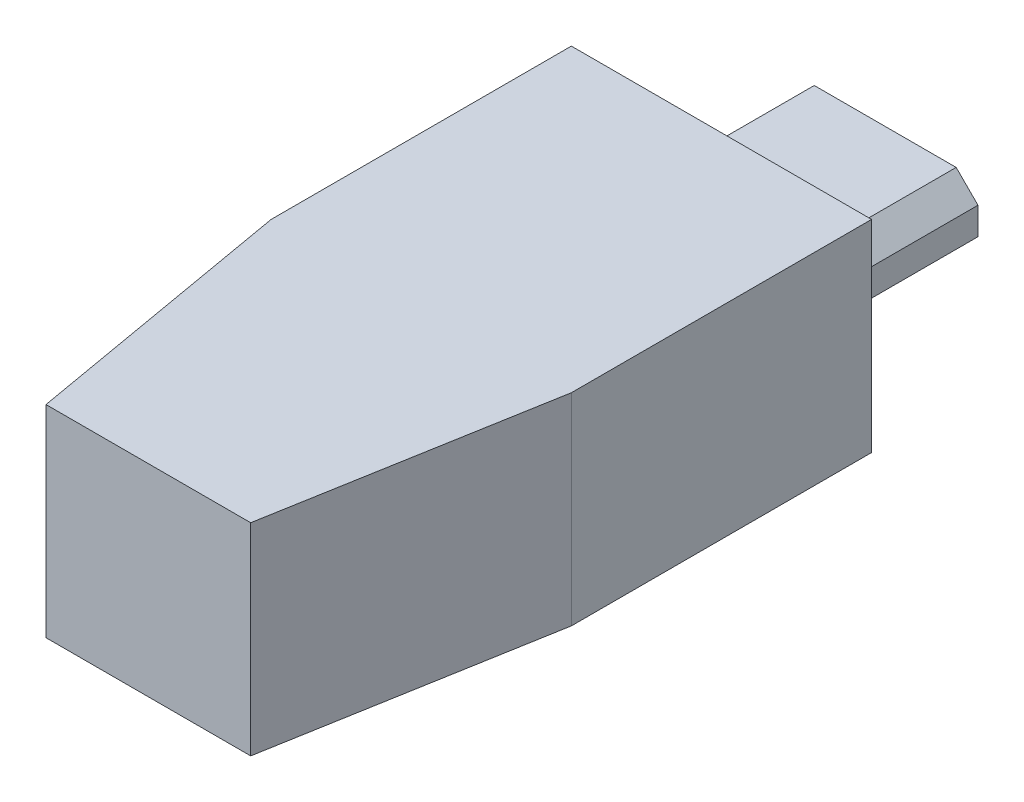
ISO-10303-21;
HEADER;
FILE_DESCRIPTION(('STEP AP214'),'2;1');
FILE_NAME('part.step','',(''),(''),'','','');
FILE_SCHEMA(('AUTOMOTIVE_DESIGN { 1 0 10303 214 1 1 1 1 }'));
ENDSEC;
DATA;
#1=APPLICATION_CONTEXT('core data for automotive mechanical design processes');
#2=APPLICATION_PROTOCOL_DEFINITION('international standard','automotive_design',2000,#1);
#3=PRODUCT_CONTEXT('',#1,'mechanical');
#4=PRODUCT('Part','Part','',(#3));
#5=PRODUCT_RELATED_PRODUCT_CATEGORY('part','',(#4));
#6=PRODUCT_DEFINITION_FORMATION('','',#4);
#7=PRODUCT_DEFINITION_CONTEXT('part definition',#1,'design');
#8=PRODUCT_DEFINITION('design','',#6,#7);
#9=PRODUCT_DEFINITION_SHAPE('','',#8);
#10=(LENGTH_UNIT() NAMED_UNIT(*) SI_UNIT(.MILLI.,.METRE.));
#11=(NAMED_UNIT(*) PLANE_ANGLE_UNIT() SI_UNIT($,.RADIAN.));
#12=(NAMED_UNIT(*) SI_UNIT($,.STERADIAN.) SOLID_ANGLE_UNIT());
#13=UNCERTAINTY_MEASURE_WITH_UNIT(LENGTH_MEASURE(1.E-05),#10,'distance_accuracy_value','');
#14=(GEOMETRIC_REPRESENTATION_CONTEXT(3) GLOBAL_UNCERTAINTY_ASSIGNED_CONTEXT((#13)) GLOBAL_UNIT_ASSIGNED_CONTEXT((#10,
#11,#12)) REPRESENTATION_CONTEXT('',''));
#15=CARTESIAN_POINT('',(0.,0.,0.));
#16=DIRECTION('',(0.,0.,1.));
#17=DIRECTION('',(1.,0.,0.));
#18=AXIS2_PLACEMENT_3D('',#15,#16,#17);
#19=CARTESIAN_POINT('',(0.,0.,0.));
#20=DIRECTION('',(0.,0.,1.));
#21=DIRECTION('',(1.,0.,0.));
#22=AXIS2_PLACEMENT_3D('',#19,#20,#21);
#23=PLANE('',#22);
#24=DIRECTION('',(0.,1.,0.));
#25=VECTOR('',#24,1.);
#26=CARTESIAN_POINT('',(5.5,3.7,0.));
#27=LINE('',#26,#25);
#28=CARTESIAN_POINT('',(5.5,-3.7,0.));
#29=VERTEX_POINT('',#28);
#30=CARTESIAN_POINT('',(5.5,3.7,0.));
#31=VERTEX_POINT('',#30);
#32=EDGE_CURVE('E184',#29,#31,#27,.T.);
#33=ORIENTED_EDGE('',*,*,#32,.F.);
#34=DIRECTION('',(1.,0.,0.));
#35=VECTOR('',#34,1.);
#36=CARTESIAN_POINT('',(-5.5,-3.7,0.));
#37=LINE('',#36,#35);
#38=CARTESIAN_POINT('',(-5.5,-3.7,0.));
#39=VERTEX_POINT('',#38);
#40=EDGE_CURVE('E190',#39,#29,#37,.T.);
#41=ORIENTED_EDGE('',*,*,#40,.F.);
#42=DIRECTION('',(0.,-1.,0.));
#43=VECTOR('',#42,1.);
#44=CARTESIAN_POINT('',(-5.5,3.7,0.));
#45=LINE('',#44,#43);
#46=CARTESIAN_POINT('',(-5.5,3.7,0.));
#47=VERTEX_POINT('',#46);
#48=EDGE_CURVE('E202',#47,#39,#45,.T.);
#49=ORIENTED_EDGE('',*,*,#48,.F.);
#50=DIRECTION('',(-1.,0.,0.));
#51=VECTOR('',#50,1.);
#52=CARTESIAN_POINT('',(-5.5,3.7,0.));
#53=LINE('',#52,#51);
#54=EDGE_CURVE('E198',#31,#47,#53,.T.);
#55=ORIENTED_EDGE('',*,*,#54,.F.);
#56=EDGE_LOOP('',(#33,#41,#49,#55));
#57=FACE_BOUND('',#56,.T.);
#58=DIRECTION('',(0.,1.,0.));
#59=VECTOR('',#58,1.);
#60=CARTESIAN_POINT('',(-3.4,0.0999999999999999,0.));
#61=LINE('',#60,#59);
#62=CARTESIAN_POINT('',(-3.4,-0.9,0.));
#63=VERTEX_POINT('',#62);
#64=CARTESIAN_POINT('',(-3.4,0.0999999999999999,0.));
#65=VERTEX_POINT('',#64);
#66=EDGE_CURVE('E61',#63,#65,#61,.T.);
#67=ORIENTED_EDGE('',*,*,#66,.F.);
#68=DIRECTION('',(-1.,0.,0.));
#69=VECTOR('',#68,1.);
#70=CARTESIAN_POINT('',(3.4,-0.9,0.));
#71=LINE('',#70,#69);
#72=CARTESIAN_POINT('',(3.4,-0.9,0.));
#73=VERTEX_POINT('',#72);
#74=EDGE_CURVE('E65',#73,#63,#71,.T.);
#75=ORIENTED_EDGE('',*,*,#74,.F.);
#76=DIRECTION('',(0.,-1.,0.));
#77=VECTOR('',#76,1.);
#78=CARTESIAN_POINT('',(3.4,0.0999999999999917,0.));
#79=LINE('',#78,#77);
#80=CARTESIAN_POINT('',(3.4,0.0999999999999917,0.));
#81=VERTEX_POINT('',#80);
#82=EDGE_CURVE('E368',#81,#73,#79,.T.);
#83=ORIENTED_EDGE('',*,*,#82,.F.);
#84=DIRECTION('',(0.707106781186543,-0.707106781186552,0.));
#85=VECTOR('',#84,1.);
#86=CARTESIAN_POINT('',(3.4,0.0999999999999917,0.));
#87=LINE('',#86,#85);
#88=CARTESIAN_POINT('',(2.6,0.9,0.));
#89=VERTEX_POINT('',#88);
#90=EDGE_CURVE('E388',#89,#81,#87,.T.);
#91=ORIENTED_EDGE('',*,*,#90,.F.);
#92=DIRECTION('',(1.,0.,0.));
#93=VECTOR('',#92,1.);
#94=CARTESIAN_POINT('',(2.6,0.9,0.));
#95=LINE('',#94,#93);
#96=CARTESIAN_POINT('',(-2.6,0.9,0.));
#97=VERTEX_POINT('',#96);
#98=EDGE_CURVE('E391',#97,#89,#95,.T.);
#99=ORIENTED_EDGE('',*,*,#98,.F.);
#100=DIRECTION('',(0.707106781186547,0.707106781186548,0.));
#101=VECTOR('',#100,1.);
#102=CARTESIAN_POINT('',(-2.6,0.9,0.));
#103=LINE('',#102,#101);
#104=EDGE_CURVE('E393',#65,#97,#103,.T.);
#105=ORIENTED_EDGE('',*,*,#104,.F.);
#106=EDGE_LOOP('',(#67,#75,#83,#91,#99,#105));
#107=FACE_BOUND('',#106,.T.);
#108=ADVANCED_FACE('F45',(#57,#107),#23,.F.);
#109=CARTESIAN_POINT('',(5.5,3.7,21.));
#110=DIRECTION('',(-1.,0.,0.));
#111=DIRECTION('',(0.,0.,1.));
#112=AXIS2_PLACEMENT_3D('',#109,#110,#111);
#113=PLANE('',#112);
#114=DIRECTION('',(0.,0.,-1.));
#115=VECTOR('',#114,1.);
#116=CARTESIAN_POINT('',(5.5,3.7,21.));
#117=LINE('',#116,#115);
#118=CARTESIAN_POINT('',(5.5,3.7,11.));
#119=VERTEX_POINT('',#118);
#120=EDGE_CURVE('E217',#119,#31,#117,.T.);
#121=ORIENTED_EDGE('',*,*,#120,.F.);
#122=DIRECTION('',(0.,1.,0.));
#123=VECTOR('',#122,1.);
#124=CARTESIAN_POINT('',(5.5,-17.3,11.));
#125=LINE('',#124,#123);
#126=CARTESIAN_POINT('',(5.5,-3.7,11.));
#127=VERTEX_POINT('',#126);
#128=EDGE_CURVE('E169',#127,#119,#125,.T.);
#129=ORIENTED_EDGE('',*,*,#128,.F.);
#130=DIRECTION('',(0.,0.,-1.));
#131=VECTOR('',#130,1.);
#132=CARTESIAN_POINT('',(5.5,-3.7,21.));
#133=LINE('',#132,#131);
#134=EDGE_CURVE('E194',#127,#29,#133,.T.);
#135=ORIENTED_EDGE('',*,*,#134,.T.);
#136=ORIENTED_EDGE('',*,*,#32,.T.);
#137=EDGE_LOOP('',(#121,#129,#135,#136));
#138=FACE_BOUND('',#137,.T.);
#139=ADVANCED_FACE('F47',(#138),#113,.F.);
#140=CARTESIAN_POINT('',(-5.5,3.7,21.));
#141=DIRECTION('',(0.,-1.,0.));
#142=DIRECTION('',(0.,0.,-1.));
#143=AXIS2_PLACEMENT_3D('',#140,#141,#142);
#144=PLANE('',#143);
#145=DIRECTION('',(0.,0.,-1.));
#146=VECTOR('',#145,1.);
#147=CARTESIAN_POINT('',(-5.5,3.7,21.));
#148=LINE('',#147,#146);
#149=CARTESIAN_POINT('',(-5.5,3.7,11.));
#150=VERTEX_POINT('',#149);
#151=EDGE_CURVE('E214',#150,#47,#148,.T.);
#152=ORIENTED_EDGE('',*,*,#151,.F.);
#153=DIRECTION('',(-0.172380331752248,0.,-0.985030467155704));
#154=VECTOR('',#153,1.);
#155=CARTESIAN_POINT('',(-5.5,3.7,11.));
#156=LINE('',#155,#154);
#157=CARTESIAN_POINT('',(-3.75,3.7,21.));
#158=VERTEX_POINT('',#157);
#159=EDGE_CURVE('E161',#158,#150,#156,.T.);
#160=ORIENTED_EDGE('',*,*,#159,.F.);
#161=DIRECTION('',(-1.,0.,0.));
#162=VECTOR('',#161,1.);
#163=CARTESIAN_POINT('',(-5.5,3.7,21.));
#164=LINE('',#163,#162);
#165=CARTESIAN_POINT('',(3.75,3.7,21.));
#166=VERTEX_POINT('',#165);
#167=EDGE_CURVE('E185',#166,#158,#164,.T.);
#168=ORIENTED_EDGE('',*,*,#167,.F.);
#169=DIRECTION('',(-0.172380331752248,0.,0.985030467155704));
#170=VECTOR('',#169,1.);
#171=CARTESIAN_POINT('',(3.75,3.7,21.));
#172=LINE('',#171,#170);
#173=EDGE_CURVE('E157',#119,#166,#172,.T.);
#174=ORIENTED_EDGE('',*,*,#173,.F.);
#175=ORIENTED_EDGE('',*,*,#120,.T.);
#176=ORIENTED_EDGE('',*,*,#54,.T.);
#177=EDGE_LOOP('',(#152,#160,#168,#174,#175,#176));
#178=FACE_BOUND('',#177,.T.);
#179=ADVANCED_FACE('F238',(#178),#144,.F.);
#180=CARTESIAN_POINT('',(-5.5,3.7,21.));
#181=DIRECTION('',(1.,0.,0.));
#182=DIRECTION('',(0.,0.,-1.));
#183=AXIS2_PLACEMENT_3D('',#180,#181,#182);
#184=PLANE('',#183);
#185=DIRECTION('',(0.,0.,-1.));
#186=VECTOR('',#185,1.);
#187=CARTESIAN_POINT('',(-5.5,-3.7,21.));
#188=LINE('',#187,#186);
#189=CARTESIAN_POINT('',(-5.5,-3.7,11.));
#190=VERTEX_POINT('',#189);
#191=EDGE_CURVE('E211',#190,#39,#188,.T.);
#192=ORIENTED_EDGE('',*,*,#191,.F.);
#193=DIRECTION('',(0.,1.,0.));
#194=VECTOR('',#193,1.);
#195=CARTESIAN_POINT('',(-5.5,-17.3,11.));
#196=LINE('',#195,#194);
#197=EDGE_CURVE('E170',#190,#150,#196,.T.);
#198=ORIENTED_EDGE('',*,*,#197,.T.);
#199=ORIENTED_EDGE('',*,*,#151,.T.);
#200=ORIENTED_EDGE('',*,*,#48,.T.);
#201=EDGE_LOOP('',(#192,#198,#199,#200));
#202=FACE_BOUND('',#201,.T.);
#203=ADVANCED_FACE('F243',(#202),#184,.F.);
#204=CARTESIAN_POINT('',(-5.5,-3.7,21.));
#205=DIRECTION('',(0.,1.,0.));
#206=DIRECTION('',(0.,0.,1.));
#207=AXIS2_PLACEMENT_3D('',#204,#205,#206);
#208=PLANE('',#207);
#209=DIRECTION('',(1.,0.,0.));
#210=VECTOR('',#209,1.);
#211=CARTESIAN_POINT('',(-5.5,-3.7,21.));
#212=LINE('',#211,#210);
#213=CARTESIAN_POINT('',(-3.75,-3.7,21.));
#214=VERTEX_POINT('',#213);
#215=CARTESIAN_POINT('',(3.75,-3.7,21.));
#216=VERTEX_POINT('',#215);
#217=EDGE_CURVE('E189',#214,#216,#212,.T.);
#218=ORIENTED_EDGE('',*,*,#217,.F.);
#219=DIRECTION('',(-0.172380331752248,0.,-0.985030467155704));
#220=VECTOR('',#219,1.);
#221=CARTESIAN_POINT('',(-3.80200121285628,-3.7,20.7028502122499));
#222=LINE('',#221,#220);
#223=EDGE_CURVE('E180',#214,#190,#222,.T.);
#224=ORIENTED_EDGE('',*,*,#223,.T.);
#225=ORIENTED_EDGE('',*,*,#191,.T.);
#226=ORIENTED_EDGE('',*,*,#40,.T.);
#227=ORIENTED_EDGE('',*,*,#134,.F.);
#228=DIRECTION('',(-0.172380331752248,0.,0.985030467155704));
#229=VECTOR('',#228,1.);
#230=CARTESIAN_POINT('',(3.47513644633111,-3.7,22.5706488781079));
#231=LINE('',#230,#229);
#232=EDGE_CURVE('E174',#127,#216,#231,.T.);
#233=ORIENTED_EDGE('',*,*,#232,.T.);
#234=EDGE_LOOP('',(#218,#224,#225,#226,#227,#233));
#235=FACE_BOUND('',#234,.T.);
#236=ADVANCED_FACE('F230',(#235),#208,.F.);
#237=CARTESIAN_POINT('',(0.,0.,21.));
#238=DIRECTION('',(0.,0.,1.));
#239=DIRECTION('',(1.,0.,0.));
#240=AXIS2_PLACEMENT_3D('',#237,#238,#239);
#241=PLANE('',#240);
#242=DIRECTION('',(0.,1.,0.));
#243=VECTOR('',#242,1.);
#244=CARTESIAN_POINT('',(-3.75,0.,21.));
#245=LINE('',#244,#243);
#246=EDGE_CURVE('E11',#214,#158,#245,.T.);
#247=ORIENTED_EDGE('',*,*,#246,.F.);
#248=ORIENTED_EDGE('',*,*,#217,.T.);
#249=DIRECTION('',(0.,-1.,0.));
#250=VECTOR('',#249,1.);
#251=CARTESIAN_POINT('',(3.75,0.,21.));
#252=LINE('',#251,#250);
#253=EDGE_CURVE('E54',#166,#216,#252,.T.);
#254=ORIENTED_EDGE('',*,*,#253,.F.);
#255=ORIENTED_EDGE('',*,*,#167,.T.);
#256=EDGE_LOOP('',(#247,#248,#254,#255));
#257=FACE_BOUND('',#256,.T.);
#258=ADVANCED_FACE('F232',(#257),#241,.T.);
#259=CARTESIAN_POINT('',(3.75,-17.3,21.));
#260=DIRECTION('',(-0.985030467155704,0.,-0.172380331752248));
#261=DIRECTION('',(-0.172380331752248,0.,0.985030467155704));
#262=AXIS2_PLACEMENT_3D('',#259,#260,#261);
#263=PLANE('',#262);
#264=ORIENTED_EDGE('',*,*,#128,.T.);
#265=ORIENTED_EDGE('',*,*,#173,.T.);
#266=ORIENTED_EDGE('',*,*,#253,.T.);
#267=ORIENTED_EDGE('',*,*,#232,.F.);
#268=EDGE_LOOP('',(#264,#265,#266,#267));
#269=FACE_BOUND('',#268,.T.);
#270=ADVANCED_FACE('F222',(#269),#263,.F.);
#271=CARTESIAN_POINT('',(-5.5,-17.3,11.));
#272=DIRECTION('',(0.985030467155704,0.,-0.172380331752248));
#273=DIRECTION('',(-0.172380331752248,0.,-0.985030467155704));
#274=AXIS2_PLACEMENT_3D('',#271,#272,#273);
#275=PLANE('',#274);
#276=ORIENTED_EDGE('',*,*,#246,.T.);
#277=ORIENTED_EDGE('',*,*,#159,.T.);
#278=ORIENTED_EDGE('',*,*,#197,.F.);
#279=ORIENTED_EDGE('',*,*,#223,.F.);
#280=EDGE_LOOP('',(#276,#277,#278,#279));
#281=FACE_BOUND('',#280,.T.);
#282=ADVANCED_FACE('F235',(#281),#275,.F.);
#283=CARTESIAN_POINT('',(-3.4,0.0999999999999999,-6.));
#284=DIRECTION('',(1.,0.,0.));
#285=DIRECTION('',(0.,1.,0.));
#286=AXIS2_PLACEMENT_3D('',#283,#284,#285);
#287=PLANE('',#286);
#288=ORIENTED_EDGE('',*,*,#66,.T.);
#289=DIRECTION('',(0.,0.,1.));
#290=VECTOR('',#289,1.);
#291=CARTESIAN_POINT('',(-3.4,0.0999999999999999,-6.));
#292=LINE('',#291,#290);
#293=CARTESIAN_POINT('',(-3.4,0.0999999999999999,-6.));
#294=VERTEX_POINT('',#293);
#295=EDGE_CURVE('E137',#294,#65,#292,.T.);
#296=ORIENTED_EDGE('',*,*,#295,.F.);
#297=DIRECTION('',(0.,1.,0.));
#298=VECTOR('',#297,1.);
#299=CARTESIAN_POINT('',(-3.4,0.0999999999999999,-6.));
#300=LINE('',#299,#298);
#301=CARTESIAN_POINT('',(-3.4,-0.9,-6.));
#302=VERTEX_POINT('',#301);
#303=EDGE_CURVE('E144',#302,#294,#300,.T.);
#304=ORIENTED_EDGE('',*,*,#303,.F.);
#305=DIRECTION('',(0.,0.,1.));
#306=VECTOR('',#305,1.);
#307=CARTESIAN_POINT('',(-3.4,-0.9,-6.));
#308=LINE('',#307,#306);
#309=EDGE_CURVE('E364',#302,#63,#308,.T.);
#310=ORIENTED_EDGE('',*,*,#309,.T.);
#311=EDGE_LOOP('',(#288,#296,#304,#310));
#312=FACE_BOUND('',#311,.T.);
#313=ADVANCED_FACE('F155',(#312),#287,.F.);
#314=CARTESIAN_POINT('',(-2.6,0.9,-6.));
#315=DIRECTION('',(0.707106781186548,-0.707106781186547,0.));
#316=DIRECTION('',(0.707106781186547,0.707106781186548,0.));
#317=AXIS2_PLACEMENT_3D('',#314,#315,#316);
#318=PLANE('',#317);
#319=ORIENTED_EDGE('',*,*,#104,.T.);
#320=DIRECTION('',(0.,0.,1.));
#321=VECTOR('',#320,1.);
#322=CARTESIAN_POINT('',(-2.6,0.9,-6.));
#323=LINE('',#322,#321);
#324=CARTESIAN_POINT('',(-2.6,0.9,-6.));
#325=VERTEX_POINT('',#324);
#326=EDGE_CURVE('E139',#325,#97,#323,.T.);
#327=ORIENTED_EDGE('',*,*,#326,.F.);
#328=DIRECTION('',(0.707106781186547,0.707106781186548,0.));
#329=VECTOR('',#328,1.);
#330=CARTESIAN_POINT('',(-2.6,0.9,-6.));
#331=LINE('',#330,#329);
#332=EDGE_CURVE('E132',#294,#325,#331,.T.);
#333=ORIENTED_EDGE('',*,*,#332,.F.);
#334=ORIENTED_EDGE('',*,*,#295,.T.);
#335=EDGE_LOOP('',(#319,#327,#333,#334));
#336=FACE_BOUND('',#335,.T.);
#337=ADVANCED_FACE('F135',(#336),#318,.F.);
#338=CARTESIAN_POINT('',(2.6,0.9,-6.));
#339=DIRECTION('',(0.,-1.,0.));
#340=DIRECTION('',(0.,0.,-1.));
#341=AXIS2_PLACEMENT_3D('',#338,#339,#340);
#342=PLANE('',#341);
#343=ORIENTED_EDGE('',*,*,#98,.T.);
#344=DIRECTION('',(0.,0.,1.));
#345=VECTOR('',#344,1.);
#346=CARTESIAN_POINT('',(2.6,0.9,-6.));
#347=LINE('',#346,#345);
#348=CARTESIAN_POINT('',(2.6,0.9,-6.));
#349=VERTEX_POINT('',#348);
#350=EDGE_CURVE('E163',#349,#89,#347,.T.);
#351=ORIENTED_EDGE('',*,*,#350,.F.);
#352=DIRECTION('',(1.,0.,0.));
#353=VECTOR('',#352,1.);
#354=CARTESIAN_POINT('',(2.6,0.9,-6.));
#355=LINE('',#354,#353);
#356=EDGE_CURVE('E143',#325,#349,#355,.T.);
#357=ORIENTED_EDGE('',*,*,#356,.F.);
#358=ORIENTED_EDGE('',*,*,#326,.T.);
#359=EDGE_LOOP('',(#343,#351,#357,#358));
#360=FACE_BOUND('',#359,.T.);
#361=ADVANCED_FACE('F313',(#360),#342,.F.);
#362=CARTESIAN_POINT('',(3.4,0.0999999999999917,-6.));
#363=DIRECTION('',(-0.707106781186552,-0.707106781186543,0.));
#364=DIRECTION('',(0.707106781186543,-0.707106781186552,0.));
#365=AXIS2_PLACEMENT_3D('',#362,#363,#364);
#366=PLANE('',#365);
#367=ORIENTED_EDGE('',*,*,#90,.T.);
#368=DIRECTION('',(0.,0.,1.));
#369=VECTOR('',#368,1.);
#370=CARTESIAN_POINT('',(3.4,0.0999999999999917,-6.));
#371=LINE('',#370,#369);
#372=CARTESIAN_POINT('',(3.4,0.0999999999999917,-6.));
#373=VERTEX_POINT('',#372);
#374=EDGE_CURVE('E374',#373,#81,#371,.T.);
#375=ORIENTED_EDGE('',*,*,#374,.F.);
#376=DIRECTION('',(0.707106781186543,-0.707106781186552,0.));
#377=VECTOR('',#376,1.);
#378=CARTESIAN_POINT('',(3.4,0.0999999999999917,-6.));
#379=LINE('',#378,#377);
#380=EDGE_CURVE('E389',#349,#373,#379,.T.);
#381=ORIENTED_EDGE('',*,*,#380,.F.);
#382=ORIENTED_EDGE('',*,*,#350,.T.);
#383=EDGE_LOOP('',(#367,#375,#381,#382));
#384=FACE_BOUND('',#383,.T.);
#385=ADVANCED_FACE('F322',(#384),#366,.F.);
#386=CARTESIAN_POINT('',(3.4,0.0999999999999917,-6.));
#387=DIRECTION('',(-1.,0.,0.));
#388=DIRECTION('',(0.,-1.,0.));
#389=AXIS2_PLACEMENT_3D('',#386,#387,#388);
#390=PLANE('',#389);
#391=ORIENTED_EDGE('',*,*,#82,.T.);
#392=DIRECTION('',(0.,0.,1.));
#393=VECTOR('',#392,1.);
#394=CARTESIAN_POINT('',(3.4,-0.9,-6.));
#395=LINE('',#394,#393);
#396=CARTESIAN_POINT('',(3.4,-0.9,-6.));
#397=VERTEX_POINT('',#396);
#398=EDGE_CURVE('E366',#397,#73,#395,.T.);
#399=ORIENTED_EDGE('',*,*,#398,.F.);
#400=DIRECTION('',(0.,-1.,0.));
#401=VECTOR('',#400,1.);
#402=CARTESIAN_POINT('',(3.4,0.0999999999999917,-6.));
#403=LINE('',#402,#401);
#404=EDGE_CURVE('E376',#373,#397,#403,.T.);
#405=ORIENTED_EDGE('',*,*,#404,.F.);
#406=ORIENTED_EDGE('',*,*,#374,.T.);
#407=EDGE_LOOP('',(#391,#399,#405,#406));
#408=FACE_BOUND('',#407,.T.);
#409=ADVANCED_FACE('F332',(#408),#390,.F.);
#410=CARTESIAN_POINT('',(3.4,-0.9,-6.));
#411=DIRECTION('',(0.,1.,0.));
#412=DIRECTION('',(0.,0.,1.));
#413=AXIS2_PLACEMENT_3D('',#410,#411,#412);
#414=PLANE('',#413);
#415=ORIENTED_EDGE('',*,*,#74,.T.);
#416=ORIENTED_EDGE('',*,*,#309,.F.);
#417=DIRECTION('',(-1.,0.,0.));
#418=VECTOR('',#417,1.);
#419=CARTESIAN_POINT('',(3.4,-0.9,-6.));
#420=LINE('',#419,#418);
#421=EDGE_CURVE('E149',#397,#302,#420,.T.);
#422=ORIENTED_EDGE('',*,*,#421,.F.);
#423=ORIENTED_EDGE('',*,*,#398,.T.);
#424=EDGE_LOOP('',(#415,#416,#422,#423));
#425=FACE_BOUND('',#424,.T.);
#426=ADVANCED_FACE('F342',(#425),#414,.F.);
#427=CARTESIAN_POINT('',(0.,0.,-6.));
#428=DIRECTION('',(0.,0.,-1.));
#429=DIRECTION('',(-1.,0.,0.));
#430=AXIS2_PLACEMENT_3D('',#427,#428,#429);
#431=PLANE('',#430);
#432=ORIENTED_EDGE('',*,*,#303,.T.);
#433=ORIENTED_EDGE('',*,*,#332,.T.);
#434=ORIENTED_EDGE('',*,*,#356,.T.);
#435=ORIENTED_EDGE('',*,*,#380,.T.);
#436=ORIENTED_EDGE('',*,*,#404,.T.);
#437=ORIENTED_EDGE('',*,*,#421,.T.);
#438=EDGE_LOOP('',(#432,#433,#434,#435,#436,#437));
#439=FACE_BOUND('',#438,.T.);
#440=ADVANCED_FACE('F147',(#439),#431,.T.);
#441=CLOSED_SHELL('',(#108,#139,#179,#203,#236,#258,#270,#282,#313,#337,#361,#385,#409,#426,#440));
#442=MANIFOLD_SOLID_BREP('B2',#441);
#443=ADVANCED_BREP_SHAPE_REPRESENTATION('',(#18,#442),#14);
#444=SHAPE_DEFINITION_REPRESENTATION(#9,#443);
ENDSEC;
END-ISO-10303-21;
